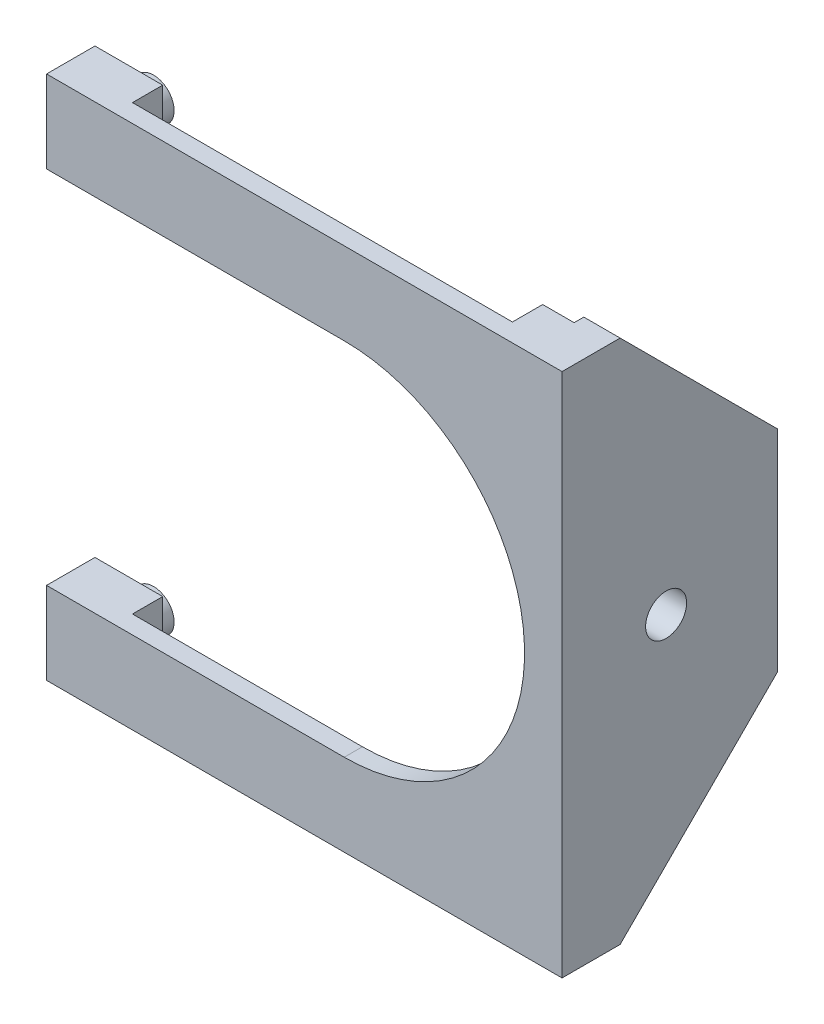
ISO-10303-21;
HEADER;
FILE_DESCRIPTION(('STEP AP214'),'2;1');
FILE_NAME('part.step','',(''),(''),'','','');
FILE_SCHEMA(('AUTOMOTIVE_DESIGN { 1 0 10303 214 1 1 1 1 }'));
ENDSEC;
DATA;
#1=APPLICATION_CONTEXT('core data for automotive mechanical design processes');
#2=APPLICATION_PROTOCOL_DEFINITION('international standard','automotive_design',2000,#1);
#3=PRODUCT_CONTEXT('',#1,'mechanical');
#4=PRODUCT('Part','Part','',(#3));
#5=PRODUCT_RELATED_PRODUCT_CATEGORY('part','',(#4));
#6=PRODUCT_DEFINITION_FORMATION('','',#4);
#7=PRODUCT_DEFINITION_CONTEXT('part definition',#1,'design');
#8=PRODUCT_DEFINITION('design','',#6,#7);
#9=PRODUCT_DEFINITION_SHAPE('','',#8);
#10=(LENGTH_UNIT() NAMED_UNIT(*) SI_UNIT(.MILLI.,.METRE.));
#11=(NAMED_UNIT(*) PLANE_ANGLE_UNIT() SI_UNIT($,.RADIAN.));
#12=(NAMED_UNIT(*) SI_UNIT($,.STERADIAN.) SOLID_ANGLE_UNIT());
#13=UNCERTAINTY_MEASURE_WITH_UNIT(LENGTH_MEASURE(1.E-05),#10,'distance_accuracy_value','');
#14=(GEOMETRIC_REPRESENTATION_CONTEXT(3) GLOBAL_UNCERTAINTY_ASSIGNED_CONTEXT((#13)) GLOBAL_UNIT_ASSIGNED_CONTEXT((#10,
#11,#12)) REPRESENTATION_CONTEXT('',''));
#15=CARTESIAN_POINT('',(0.,0.,0.));
#16=DIRECTION('',(0.,0.,1.));
#17=DIRECTION('',(1.,0.,0.));
#18=AXIS2_PLACEMENT_3D('',#15,#16,#17);
#19=CARTESIAN_POINT('',(-43.18,27.559,-5.08000000000001));
#20=DIRECTION('',(0.,0.,1.));
#21=DIRECTION('',(1.,0.,0.));
#22=AXIS2_PLACEMENT_3D('',#19,#20,#21);
#23=PLANE('',#22);
#24=DIRECTION('',(1.,0.,0.));
#25=VECTOR('',#24,1.);
#26=CARTESIAN_POINT('',(-19.05,-18.923,-5.08));
#27=LINE('',#26,#25);
#28=CARTESIAN_POINT('',(-50.292,-18.923,-5.08000000000001));
#29=VERTEX_POINT('',#28);
#30=CARTESIAN_POINT('',(-43.18,-18.923,-5.08000000000001));
#31=VERTEX_POINT('',#30);
#32=EDGE_CURVE('E266',#29,#31,#27,.T.);
#33=ORIENTED_EDGE('',*,*,#32,.T.);
#34=DIRECTION('',(0.,-1.,0.));
#35=VECTOR('',#34,1.);
#36=CARTESIAN_POINT('',(-43.18,27.559,-5.08000000000001));
#37=LINE('',#36,#35);
#38=CARTESIAN_POINT('',(-43.18,-27.559,-5.08000000000001));
#39=VERTEX_POINT('',#38);
#40=EDGE_CURVE('E249',#31,#39,#37,.T.);
#41=ORIENTED_EDGE('',*,*,#40,.T.);
#42=DIRECTION('',(-1.,0.,0.));
#43=VECTOR('',#42,1.);
#44=CARTESIAN_POINT('',(-43.18,-27.559,-5.08000000000001));
#45=LINE('',#44,#43);
#46=CARTESIAN_POINT('',(-50.292,-27.559,-5.08000000000001));
#47=VERTEX_POINT('',#46);
#48=EDGE_CURVE('E196',#39,#47,#45,.T.);
#49=ORIENTED_EDGE('',*,*,#48,.T.);
#50=DIRECTION('',(0.,-1.,0.));
#51=VECTOR('',#50,1.);
#52=CARTESIAN_POINT('',(-50.292,27.559,-5.08000000000001));
#53=LINE('',#52,#51);
#54=EDGE_CURVE('E245',#29,#47,#53,.T.);
#55=ORIENTED_EDGE('',*,*,#54,.F.);
#56=EDGE_LOOP('',(#33,#41,#49,#55));
#57=FACE_BOUND('',#56,.T.);
#58=CARTESIAN_POINT('',(-46.736,-23.241,-5.08000000000001));
#59=DIRECTION('',(0.,0.,1.));
#60=DIRECTION('',(1.,0.,0.));
#61=AXIS2_PLACEMENT_3D('',#58,#59,#60);
#62=CIRCLE('',#61,2.15900000000001);
#63=CARTESIAN_POINT('',(-44.577,-23.241,-5.08000000000001));
#64=VERTEX_POINT('',#63);
#65=EDGE_CURVE('E326',#64,#64,#62,.F.);
#66=ORIENTED_EDGE('',*,*,#65,.F.);
#67=EDGE_LOOP('',(#66));
#68=FACE_BOUND('',#67,.T.);
#69=ADVANCED_FACE('F49',(#57,#68),#23,.F.);
#70=DIRECTION('',(-1.,0.,0.));
#71=VECTOR('',#70,1.);
#72=CARTESIAN_POINT('',(-19.05,18.923,-5.08));
#73=LINE('',#72,#71);
#74=CARTESIAN_POINT('',(-43.18,18.923,-5.08000000000001));
#75=VERTEX_POINT('',#74);
#76=CARTESIAN_POINT('',(-50.292,18.923,-5.08000000000001));
#77=VERTEX_POINT('',#76);
#78=EDGE_CURVE('E315',#75,#77,#73,.T.);
#79=ORIENTED_EDGE('',*,*,#78,.T.);
#80=CARTESIAN_POINT('',(-50.292,27.559,-5.08000000000001));
#81=VERTEX_POINT('',#80);
#82=EDGE_CURVE('E241',#81,#77,#53,.T.);
#83=ORIENTED_EDGE('',*,*,#82,.F.);
#84=DIRECTION('',(-1.,0.,0.));
#85=VECTOR('',#84,1.);
#86=CARTESIAN_POINT('',(-43.18,27.559,-5.08000000000001));
#87=LINE('',#86,#85);
#88=CARTESIAN_POINT('',(-43.18,27.559,-5.08000000000001));
#89=VERTEX_POINT('',#88);
#90=EDGE_CURVE('E224',#89,#81,#87,.T.);
#91=ORIENTED_EDGE('',*,*,#90,.F.);
#92=EDGE_CURVE('E246',#89,#75,#37,.T.);
#93=ORIENTED_EDGE('',*,*,#92,.T.);
#94=EDGE_LOOP('',(#79,#83,#91,#93));
#95=FACE_BOUND('',#94,.T.);
#96=CARTESIAN_POINT('',(-46.736,23.241,-5.08000000000001));
#97=DIRECTION('',(0.,0.,1.));
#98=DIRECTION('',(1.,0.,0.));
#99=AXIS2_PLACEMENT_3D('',#96,#97,#98);
#100=CIRCLE('',#99,2.15900000000001);
#101=CARTESIAN_POINT('',(-44.577,23.241,-5.08000000000001));
#102=VERTEX_POINT('',#101);
#103=EDGE_CURVE('E323',#102,#102,#100,.F.);
#104=ORIENTED_EDGE('',*,*,#103,.F.);
#105=EDGE_LOOP('',(#104));
#106=FACE_BOUND('',#105,.T.);
#107=ADVANCED_FACE('F407',(#95,#106),#23,.F.);
#108=CARTESIAN_POINT('',(-50.292,27.559,-22.606));
#109=DIRECTION('',(-1.,0.,0.));
#110=DIRECTION('',(0.,-1.,0.));
#111=AXIS2_PLACEMENT_3D('',#108,#109,#110);
#112=PLANE('',#111);
#113=ORIENTED_EDGE('',*,*,#82,.T.);
#114=DIRECTION('',(0.,0.,1.));
#115=VECTOR('',#114,1.);
#116=CARTESIAN_POINT('',(-50.292,18.923,-22.606));
#117=LINE('',#116,#115);
#118=CARTESIAN_POINT('',(-50.292,18.923,0.));
#119=VERTEX_POINT('',#118);
#120=EDGE_CURVE('E272',#77,#119,#117,.T.);
#121=ORIENTED_EDGE('',*,*,#120,.T.);
#122=DIRECTION('',(0.,-1.,0.));
#123=VECTOR('',#122,1.);
#124=CARTESIAN_POINT('',(-50.292,27.559,0.));
#125=LINE('',#124,#123);
#126=CARTESIAN_POINT('',(-50.292,27.559,0.));
#127=VERTEX_POINT('',#126);
#128=EDGE_CURVE('E268',#127,#119,#125,.T.);
#129=ORIENTED_EDGE('',*,*,#128,.F.);
#130=DIRECTION('',(0.,0.,1.));
#131=VECTOR('',#130,1.);
#132=CARTESIAN_POINT('',(-50.292,27.559,-22.606));
#133=LINE('',#132,#131);
#134=EDGE_CURVE('E296',#81,#127,#133,.T.);
#135=ORIENTED_EDGE('',*,*,#134,.F.);
#136=EDGE_LOOP('',(#113,#121,#129,#135));
#137=FACE_BOUND('',#136,.T.);
#138=ADVANCED_FACE('F411',(#137),#112,.T.);
#139=CARTESIAN_POINT('',(-50.292,27.559,-22.606));
#140=DIRECTION('',(0.,1.,0.));
#141=DIRECTION('',(0.,0.,1.));
#142=AXIS2_PLACEMENT_3D('',#139,#140,#141);
#143=PLANE('',#142);
#144=DIRECTION('',(0.,0.,1.));
#145=VECTOR('',#144,1.);
#146=CARTESIAN_POINT('',(3.81000000000001,27.559,-22.606));
#147=LINE('',#146,#145);
#148=CARTESIAN_POINT('',(3.81000000000001,27.559,-6.09600000000001));
#149=VERTEX_POINT('',#148);
#150=CARTESIAN_POINT('',(3.81000000000001,27.559,0.));
#151=VERTEX_POINT('',#150);
#152=EDGE_CURVE('E299',#149,#151,#147,.T.);
#153=ORIENTED_EDGE('',*,*,#152,.F.);
#154=DIRECTION('',(-1.,0.,0.));
#155=VECTOR('',#154,1.);
#156=CARTESIAN_POINT('',(0.,27.559,-6.09600000000001));
#157=LINE('',#156,#155);
#158=CARTESIAN_POINT('',(0.,27.559,-6.09600000000001));
#159=VERTEX_POINT('',#158);
#160=EDGE_CURVE('E13',#149,#159,#157,.T.);
#161=ORIENTED_EDGE('',*,*,#160,.T.);
#162=DIRECTION('',(0.,0.,1.));
#163=VECTOR('',#162,1.);
#164=CARTESIAN_POINT('',(0.,27.559,-5.08));
#165=LINE('',#164,#163);
#166=CARTESIAN_POINT('',(0.,27.559,-5.08));
#167=VERTEX_POINT('',#166);
#168=EDGE_CURVE('E188',#159,#167,#165,.T.);
#169=ORIENTED_EDGE('',*,*,#168,.T.);
#170=DIRECTION('',(-1.,0.,0.));
#171=VECTOR('',#170,1.);
#172=CARTESIAN_POINT('',(0.,27.559,-5.08));
#173=LINE('',#172,#171);
#174=CARTESIAN_POINT('',(-3.302,27.559,-5.08));
#175=VERTEX_POINT('',#174);
#176=EDGE_CURVE('E194',#167,#175,#173,.T.);
#177=ORIENTED_EDGE('',*,*,#176,.T.);
#178=DIRECTION('',(0.,0.,1.));
#179=VECTOR('',#178,1.);
#180=CARTESIAN_POINT('',(-3.302,27.559,-5.08));
#181=LINE('',#180,#179);
#182=CARTESIAN_POINT('',(-3.302,27.559,-1.905));
#183=VERTEX_POINT('',#182);
#184=EDGE_CURVE('E213',#175,#183,#181,.T.);
#185=ORIENTED_EDGE('',*,*,#184,.T.);
#186=DIRECTION('',(-1.,0.,0.));
#187=VECTOR('',#186,1.);
#188=CARTESIAN_POINT('',(-3.302,27.559,-1.905));
#189=LINE('',#188,#187);
#190=CARTESIAN_POINT('',(-43.18,27.559,-1.905));
#191=VERTEX_POINT('',#190);
#192=EDGE_CURVE('E215',#183,#191,#189,.T.);
#193=ORIENTED_EDGE('',*,*,#192,.T.);
#194=DIRECTION('',(0.,0.,-1.));
#195=VECTOR('',#194,1.);
#196=CARTESIAN_POINT('',(-43.18,27.559,-1.905));
#197=LINE('',#196,#195);
#198=EDGE_CURVE('E221',#191,#89,#197,.T.);
#199=ORIENTED_EDGE('',*,*,#198,.T.);
#200=ORIENTED_EDGE('',*,*,#90,.T.);
#201=ORIENTED_EDGE('',*,*,#134,.T.);
#202=DIRECTION('',(-1.,0.,0.));
#203=VECTOR('',#202,1.);
#204=CARTESIAN_POINT('',(-50.292,27.559,0.));
#205=LINE('',#204,#203);
#206=EDGE_CURVE('E273',#151,#127,#205,.T.);
#207=ORIENTED_EDGE('',*,*,#206,.F.);
#208=EDGE_LOOP('',(#153,#161,#169,#177,#185,#193,#199,#200,#201,#207));
#209=FACE_BOUND('',#208,.T.);
#210=ADVANCED_FACE('F191',(#209),#143,.T.);
#211=CARTESIAN_POINT('',(3.81000000000001,27.559,-22.606));
#212=DIRECTION('',(1.,0.,0.));
#213=DIRECTION('',(0.,0.,-1.));
#214=AXIS2_PLACEMENT_3D('',#211,#212,#213);
#215=PLANE('',#214);
#216=CARTESIAN_POINT('',(3.81000000000001,0.,-10.922));
#217=DIRECTION('',(1.,0.,0.));
#218=DIRECTION('',(0.,0.,-1.));
#219=AXIS2_PLACEMENT_3D('',#216,#217,#218);
#220=CIRCLE('',#219,2.15265);
#221=CARTESIAN_POINT('',(3.81000000000001,0.,-13.07465));
#222=VERTEX_POINT('',#221);
#223=EDGE_CURVE('E646',#222,#222,#220,.T.);
#224=ORIENTED_EDGE('',*,*,#223,.F.);
#225=EDGE_LOOP('',(#224));
#226=FACE_BOUND('',#225,.T.);
#227=DIRECTION('',(0.,0.,1.));
#228=VECTOR('',#227,1.);
#229=CARTESIAN_POINT('',(3.81000000000001,-27.559,-22.606));
#230=LINE('',#229,#228);
#231=CARTESIAN_POINT('',(3.81000000000001,-27.559,-6.096));
#232=VERTEX_POINT('',#231);
#233=CARTESIAN_POINT('',(3.81000000000001,-27.559,0.));
#234=VERTEX_POINT('',#233);
#235=EDGE_CURVE('E301',#232,#234,#230,.T.);
#236=ORIENTED_EDGE('',*,*,#235,.F.);
#237=DIRECTION('',(0.,0.707106781186549,-0.707106781186546));
#238=VECTOR('',#237,1.);
#239=CARTESIAN_POINT('',(3.81000000000001,8.25500000000009,-41.91));
#240=LINE('',#239,#238);
#241=CARTESIAN_POINT('',(3.81000000000001,-11.0489999999999,-22.606));
#242=VERTEX_POINT('',#241);
#243=EDGE_CURVE('E334',#232,#242,#240,.T.);
#244=ORIENTED_EDGE('',*,*,#243,.T.);
#245=DIRECTION('',(0.,1.,0.));
#246=VECTOR('',#245,1.);
#247=CARTESIAN_POINT('',(3.81000000000001,27.559,-22.606));
#248=LINE('',#247,#246);
#249=CARTESIAN_POINT('',(3.81000000000001,11.049,-22.606));
#250=VERTEX_POINT('',#249);
#251=EDGE_CURVE('E269',#242,#250,#248,.T.);
#252=ORIENTED_EDGE('',*,*,#251,.T.);
#253=DIRECTION('',(0.,0.707106781186549,0.707106781186546));
#254=VECTOR('',#253,1.);
#255=CARTESIAN_POINT('',(3.81000000000001,19.304,-14.351));
#256=LINE('',#255,#254);
#257=EDGE_CURVE('E332',#250,#149,#256,.T.);
#258=ORIENTED_EDGE('',*,*,#257,.T.);
#259=ORIENTED_EDGE('',*,*,#152,.T.);
#260=DIRECTION('',(0.,1.,0.));
#261=VECTOR('',#260,1.);
#262=CARTESIAN_POINT('',(3.81000000000001,27.559,0.));
#263=LINE('',#262,#261);
#264=EDGE_CURVE('E291',#234,#151,#263,.T.);
#265=ORIENTED_EDGE('',*,*,#264,.F.);
#266=EDGE_LOOP('',(#236,#244,#252,#258,#259,#265));
#267=FACE_BOUND('',#266,.T.);
#268=ADVANCED_FACE('F348',(#226,#267),#215,.T.);
#269=CARTESIAN_POINT('',(-50.292,-27.559,-22.606));
#270=DIRECTION('',(0.,-1.,0.));
#271=DIRECTION('',(0.,0.,-1.));
#272=AXIS2_PLACEMENT_3D('',#269,#270,#271);
#273=PLANE('',#272);
#274=DIRECTION('',(0.,0.,1.));
#275=VECTOR('',#274,1.);
#276=CARTESIAN_POINT('',(0.,-27.559,-5.08));
#277=LINE('',#276,#275);
#278=CARTESIAN_POINT('',(0.,-27.559,-6.09600000000001));
#279=VERTEX_POINT('',#278);
#280=CARTESIAN_POINT('',(0.,-27.559,-5.08));
#281=VERTEX_POINT('',#280);
#282=EDGE_CURVE('E202',#279,#281,#277,.T.);
#283=ORIENTED_EDGE('',*,*,#282,.F.);
#284=DIRECTION('',(1.,0.,0.));
#285=VECTOR('',#284,1.);
#286=CARTESIAN_POINT('',(3.81000000000001,-27.559,-6.09600000000001));
#287=LINE('',#286,#285);
#288=EDGE_CURVE('E329',#279,#232,#287,.T.);
#289=ORIENTED_EDGE('',*,*,#288,.T.);
#290=ORIENTED_EDGE('',*,*,#235,.T.);
#291=DIRECTION('',(1.,0.,0.));
#292=VECTOR('',#291,1.);
#293=CARTESIAN_POINT('',(-50.292,-27.559,0.));
#294=LINE('',#293,#292);
#295=CARTESIAN_POINT('',(-50.292,-27.559,0.));
#296=VERTEX_POINT('',#295);
#297=EDGE_CURVE('E288',#296,#234,#294,.T.);
#298=ORIENTED_EDGE('',*,*,#297,.F.);
#299=DIRECTION('',(0.,0.,1.));
#300=VECTOR('',#299,1.);
#301=CARTESIAN_POINT('',(-50.292,-27.559,-22.606));
#302=LINE('',#301,#300);
#303=EDGE_CURVE('E303',#47,#296,#302,.T.);
#304=ORIENTED_EDGE('',*,*,#303,.F.);
#305=ORIENTED_EDGE('',*,*,#48,.F.);
#306=DIRECTION('',(0.,0.,-1.));
#307=VECTOR('',#306,1.);
#308=CARTESIAN_POINT('',(-43.18,-27.559,-1.905));
#309=LINE('',#308,#307);
#310=CARTESIAN_POINT('',(-43.18,-27.559,-1.905));
#311=VERTEX_POINT('',#310);
#312=EDGE_CURVE('E237',#311,#39,#309,.T.);
#313=ORIENTED_EDGE('',*,*,#312,.F.);
#314=DIRECTION('',(-1.,0.,0.));
#315=VECTOR('',#314,1.);
#316=CARTESIAN_POINT('',(-3.302,-27.559,-1.905));
#317=LINE('',#316,#315);
#318=CARTESIAN_POINT('',(-3.302,-27.559,-1.905));
#319=VERTEX_POINT('',#318);
#320=EDGE_CURVE('E234',#319,#311,#317,.T.);
#321=ORIENTED_EDGE('',*,*,#320,.F.);
#322=DIRECTION('',(0.,0.,1.));
#323=VECTOR('',#322,1.);
#324=CARTESIAN_POINT('',(-3.302,-27.559,-5.08));
#325=LINE('',#324,#323);
#326=CARTESIAN_POINT('',(-3.302,-27.559,-5.08));
#327=VERTEX_POINT('',#326);
#328=EDGE_CURVE('E231',#327,#319,#325,.T.);
#329=ORIENTED_EDGE('',*,*,#328,.F.);
#330=DIRECTION('',(-1.,0.,0.));
#331=VECTOR('',#330,1.);
#332=CARTESIAN_POINT('',(0.,-27.559,-5.08));
#333=LINE('',#332,#331);
#334=EDGE_CURVE('E228',#281,#327,#333,.T.);
#335=ORIENTED_EDGE('',*,*,#334,.F.);
#336=EDGE_LOOP('',(#283,#289,#290,#298,#304,#305,#313,#321,#329,#335));
#337=FACE_BOUND('',#336,.T.);
#338=ADVANCED_FACE('F343',(#337),#273,.T.);
#339=CARTESIAN_POINT('',(-50.292,-18.923,-22.606));
#340=DIRECTION('',(-1.,0.,0.));
#341=DIRECTION('',(0.,-1.,0.));
#342=AXIS2_PLACEMENT_3D('',#339,#340,#341);
#343=PLANE('',#342);
#344=ORIENTED_EDGE('',*,*,#54,.T.);
#345=ORIENTED_EDGE('',*,*,#303,.T.);
#346=DIRECTION('',(0.,-1.,0.));
#347=VECTOR('',#346,1.);
#348=CARTESIAN_POINT('',(-50.292,-18.923,0.));
#349=LINE('',#348,#347);
#350=CARTESIAN_POINT('',(-50.292,-18.923,0.));
#351=VERTEX_POINT('',#350);
#352=EDGE_CURVE('E285',#351,#296,#349,.T.);
#353=ORIENTED_EDGE('',*,*,#352,.F.);
#354=DIRECTION('',(0.,0.,1.));
#355=VECTOR('',#354,1.);
#356=CARTESIAN_POINT('',(-50.292,-18.923,-22.606));
#357=LINE('',#356,#355);
#358=EDGE_CURVE('E305',#29,#351,#357,.T.);
#359=ORIENTED_EDGE('',*,*,#358,.F.);
#360=EDGE_LOOP('',(#344,#345,#353,#359));
#361=FACE_BOUND('',#360,.T.);
#362=ADVANCED_FACE('F364',(#361),#343,.T.);
#363=CARTESIAN_POINT('',(-19.05,-18.923,-22.606));
#364=DIRECTION('',(0.,1.,0.));
#365=DIRECTION('',(-1.,0.,0.));
#366=AXIS2_PLACEMENT_3D('',#363,#364,#365);
#367=PLANE('',#366);
#368=ORIENTED_EDGE('',*,*,#32,.F.);
#369=ORIENTED_EDGE('',*,*,#358,.T.);
#370=DIRECTION('',(-1.,0.,0.));
#371=VECTOR('',#370,1.);
#372=CARTESIAN_POINT('',(-19.05,-18.923,0.));
#373=LINE('',#372,#371);
#374=CARTESIAN_POINT('',(-19.05,-18.923,0.));
#375=VERTEX_POINT('',#374);
#376=EDGE_CURVE('E282',#375,#351,#373,.T.);
#377=ORIENTED_EDGE('',*,*,#376,.F.);
#378=DIRECTION('',(0.,0.,1.));
#379=VECTOR('',#378,1.);
#380=CARTESIAN_POINT('',(-19.05,-18.923,-22.606));
#381=LINE('',#380,#379);
#382=CARTESIAN_POINT('',(-19.05,-18.923,-1.905));
#383=VERTEX_POINT('',#382);
#384=EDGE_CURVE('E307',#383,#375,#381,.T.);
#385=ORIENTED_EDGE('',*,*,#384,.F.);
#386=DIRECTION('',(1.,0.,0.));
#387=VECTOR('',#386,1.);
#388=CARTESIAN_POINT('',(-19.05,-18.923,-1.905));
#389=LINE('',#388,#387);
#390=CARTESIAN_POINT('',(-43.18,-18.923,-1.905));
#391=VERTEX_POINT('',#390);
#392=EDGE_CURVE('E262',#391,#383,#389,.T.);
#393=ORIENTED_EDGE('',*,*,#392,.F.);
#394=DIRECTION('',(0.,0.,1.));
#395=VECTOR('',#394,1.);
#396=CARTESIAN_POINT('',(-43.1800000000001,-18.923,-22.6059999999999));
#397=LINE('',#396,#395);
#398=EDGE_CURVE('E264',#31,#391,#397,.T.);
#399=ORIENTED_EDGE('',*,*,#398,.F.);
#400=EDGE_LOOP('',(#368,#369,#377,#385,#393,#399));
#401=FACE_BOUND('',#400,.T.);
#402=ADVANCED_FACE('F372',(#401),#367,.T.);
#403=CARTESIAN_POINT('',(-19.05,0.,-22.606));
#404=DIRECTION('',(0.,0.,1.));
#405=DIRECTION('',(1.,0.,0.));
#406=AXIS2_PLACEMENT_3D('',#403,#404,#405);
#407=CYLINDRICAL_SURFACE('',#406,18.923);
#408=CARTESIAN_POINT('',(-19.05,0.,-1.905));
#409=DIRECTION('',(0.,0.,1.));
#410=DIRECTION('',(1.,0.,0.));
#411=AXIS2_PLACEMENT_3D('',#408,#409,#410);
#412=CIRCLE('',#411,18.923);
#413=CARTESIAN_POINT('',(-3.302,10.49192189258,-1.905));
#414=VERTEX_POINT('',#413);
#415=CARTESIAN_POINT('',(-19.05,18.923,-1.905));
#416=VERTEX_POINT('',#415);
#417=EDGE_CURVE('E244',#414,#416,#412,.T.);
#418=ORIENTED_EDGE('',*,*,#417,.F.);
#419=DIRECTION('',(0.,0.,1.));
#420=VECTOR('',#419,1.);
#421=CARTESIAN_POINT('',(-3.30200000000001,10.49192189258,-22.606));
#422=LINE('',#421,#420);
#423=CARTESIAN_POINT('',(-3.30200000000001,10.49192189258,-5.08));
#424=VERTEX_POINT('',#423);
#425=EDGE_CURVE('E321',#424,#414,#422,.T.);
#426=ORIENTED_EDGE('',*,*,#425,.F.);
#427=CARTESIAN_POINT('',(-19.05,0.,-5.08000000000001));
#428=DIRECTION('',(0.,0.,1.));
#429=DIRECTION('',(1.,0.,0.));
#430=AXIS2_PLACEMENT_3D('',#427,#428,#429);
#431=CIRCLE('',#430,18.923);
#432=CARTESIAN_POINT('',(-3.30200000000001,-10.49192189258,-5.08));
#433=VERTEX_POINT('',#432);
#434=EDGE_CURVE('E317',#433,#424,#431,.T.);
#435=ORIENTED_EDGE('',*,*,#434,.F.);
#436=DIRECTION('',(0.,0.,1.));
#437=VECTOR('',#436,1.);
#438=CARTESIAN_POINT('',(-3.30200000000001,-10.49192189258,-22.606));
#439=LINE('',#438,#437);
#440=CARTESIAN_POINT('',(-3.302,-10.49192189258,-1.905));
#441=VERTEX_POINT('',#440);
#442=EDGE_CURVE('E319',#441,#433,#439,.F.);
#443=ORIENTED_EDGE('',*,*,#442,.F.);
#444=EDGE_CURVE('E261',#383,#441,#412,.T.);
#445=ORIENTED_EDGE('',*,*,#444,.F.);
#446=ORIENTED_EDGE('',*,*,#384,.T.);
#447=CARTESIAN_POINT('',(-19.05,0.,0.));
#448=DIRECTION('',(0.,0.,-1.));
#449=DIRECTION('',(1.,0.,0.));
#450=AXIS2_PLACEMENT_3D('',#447,#448,#449);
#451=CIRCLE('',#450,18.923);
#452=CARTESIAN_POINT('',(-19.05,18.923,0.));
#453=VERTEX_POINT('',#452);
#454=EDGE_CURVE('E279',#453,#375,#451,.T.);
#455=ORIENTED_EDGE('',*,*,#454,.F.);
#456=DIRECTION('',(0.,0.,1.));
#457=VECTOR('',#456,1.);
#458=CARTESIAN_POINT('',(-19.05,18.923,-22.606));
#459=LINE('',#458,#457);
#460=EDGE_CURVE('E309',#416,#453,#459,.T.);
#461=ORIENTED_EDGE('',*,*,#460,.F.);
#462=EDGE_LOOP('',(#418,#426,#435,#443,#445,#446,#455,#461));
#463=FACE_BOUND('',#462,.T.);
#464=ADVANCED_FACE('F392',(#463),#407,.F.);
#465=CARTESIAN_POINT('',(-19.05,18.923,-22.606));
#466=DIRECTION('',(0.,-1.,0.));
#467=DIRECTION('',(1.,0.,0.));
#468=AXIS2_PLACEMENT_3D('',#465,#466,#467);
#469=PLANE('',#468);
#470=ORIENTED_EDGE('',*,*,#78,.F.);
#471=DIRECTION('',(0.,0.,-1.));
#472=VECTOR('',#471,1.);
#473=CARTESIAN_POINT('',(-43.1800000000001,18.923,-22.6059999999999));
#474=LINE('',#473,#472);
#475=CARTESIAN_POINT('',(-43.18,18.923,-1.905));
#476=VERTEX_POINT('',#475);
#477=EDGE_CURVE('E313',#476,#75,#474,.T.);
#478=ORIENTED_EDGE('',*,*,#477,.F.);
#479=DIRECTION('',(-1.,0.,0.));
#480=VECTOR('',#479,1.);
#481=CARTESIAN_POINT('',(-19.05,18.923,-1.905));
#482=LINE('',#481,#480);
#483=EDGE_CURVE('E298',#416,#476,#482,.T.);
#484=ORIENTED_EDGE('',*,*,#483,.F.);
#485=ORIENTED_EDGE('',*,*,#460,.T.);
#486=DIRECTION('',(1.,0.,0.));
#487=VECTOR('',#486,1.);
#488=CARTESIAN_POINT('',(-19.05,18.923,0.));
#489=LINE('',#488,#487);
#490=EDGE_CURVE('E276',#119,#453,#489,.T.);
#491=ORIENTED_EDGE('',*,*,#490,.F.);
#492=ORIENTED_EDGE('',*,*,#120,.F.);
#493=EDGE_LOOP('',(#470,#478,#484,#485,#491,#492));
#494=FACE_BOUND('',#493,.T.);
#495=ADVANCED_FACE('F414',(#494),#469,.T.);
#496=CARTESIAN_POINT('',(-19.05,0.,-22.606));
#497=DIRECTION('',(0.,0.,1.));
#498=DIRECTION('',(1.,0.,0.));
#499=AXIS2_PLACEMENT_3D('',#496,#497,#498);
#500=PLANE('',#499);
#501=ORIENTED_EDGE('',*,*,#251,.F.);
#502=DIRECTION('',(-1.,0.,0.));
#503=VECTOR('',#502,1.);
#504=CARTESIAN_POINT('',(0.,-11.049,-22.606));
#505=LINE('',#504,#503);
#506=CARTESIAN_POINT('',(0.,-11.049,-22.606));
#507=VERTEX_POINT('',#506);
#508=EDGE_CURVE('E71',#242,#507,#505,.T.);
#509=ORIENTED_EDGE('',*,*,#508,.T.);
#510=DIRECTION('',(0.,-1.,0.));
#511=VECTOR('',#510,1.);
#512=CARTESIAN_POINT('',(0.,27.559,-22.606));
#513=LINE('',#512,#511);
#514=CARTESIAN_POINT('',(0.,11.049,-22.606));
#515=VERTEX_POINT('',#514);
#516=EDGE_CURVE('E207',#515,#507,#513,.T.);
#517=ORIENTED_EDGE('',*,*,#516,.F.);
#518=DIRECTION('',(1.,0.,0.));
#519=VECTOR('',#518,1.);
#520=CARTESIAN_POINT('',(3.81000000000001,11.049,-22.606));
#521=LINE('',#520,#519);
#522=EDGE_CURVE('E336',#515,#250,#521,.T.);
#523=ORIENTED_EDGE('',*,*,#522,.T.);
#524=EDGE_LOOP('',(#501,#509,#517,#523));
#525=FACE_BOUND('',#524,.T.);
#526=ADVANCED_FACE('F351',(#525),#500,.F.);
#527=CARTESIAN_POINT('',(-19.05,0.,0.));
#528=DIRECTION('',(0.,0.,1.));
#529=DIRECTION('',(1.,0.,0.));
#530=AXIS2_PLACEMENT_3D('',#527,#528,#529);
#531=PLANE('',#530);
#532=ORIENTED_EDGE('',*,*,#128,.T.);
#533=ORIENTED_EDGE('',*,*,#490,.T.);
#534=ORIENTED_EDGE('',*,*,#454,.T.);
#535=ORIENTED_EDGE('',*,*,#376,.T.);
#536=ORIENTED_EDGE('',*,*,#352,.T.);
#537=ORIENTED_EDGE('',*,*,#297,.T.);
#538=ORIENTED_EDGE('',*,*,#264,.T.);
#539=ORIENTED_EDGE('',*,*,#206,.T.);
#540=EDGE_LOOP('',(#532,#533,#534,#535,#536,#537,#538,#539));
#541=FACE_BOUND('',#540,.T.);
#542=ADVANCED_FACE('F356',(#541),#531,.T.);
#543=CARTESIAN_POINT('',(-3.302,27.559,-5.08));
#544=DIRECTION('',(1.,0.,0.));
#545=DIRECTION('',(0.,0.,-1.));
#546=AXIS2_PLACEMENT_3D('',#543,#544,#545);
#547=PLANE('',#546);
#548=ORIENTED_EDGE('',*,*,#425,.T.);
#549=DIRECTION('',(0.,-1.,0.));
#550=VECTOR('',#549,1.);
#551=CARTESIAN_POINT('',(-3.302,27.559,-1.905));
#552=LINE('',#551,#550);
#553=EDGE_CURVE('E254',#183,#414,#552,.T.);
#554=ORIENTED_EDGE('',*,*,#553,.F.);
#555=ORIENTED_EDGE('',*,*,#184,.F.);
#556=DIRECTION('',(0.,-1.,0.));
#557=VECTOR('',#556,1.);
#558=CARTESIAN_POINT('',(-3.302,27.559,-5.08));
#559=LINE('',#558,#557);
#560=EDGE_CURVE('E211',#175,#424,#559,.T.);
#561=ORIENTED_EDGE('',*,*,#560,.T.);
#562=EDGE_LOOP('',(#548,#554,#555,#561));
#563=FACE_BOUND('',#562,.T.);
#564=ADVANCED_FACE('F395',(#563),#547,.F.);
#565=CARTESIAN_POINT('',(-43.18,27.559,-1.905));
#566=DIRECTION('',(-1.,0.,0.));
#567=DIRECTION('',(0.,0.,1.));
#568=AXIS2_PLACEMENT_3D('',#565,#566,#567);
#569=PLANE('',#568);
#570=ORIENTED_EDGE('',*,*,#398,.T.);
#571=DIRECTION('',(0.,-1.,0.));
#572=VECTOR('',#571,1.);
#573=CARTESIAN_POINT('',(-43.18,27.559,-1.905));
#574=LINE('',#573,#572);
#575=EDGE_CURVE('E253',#391,#311,#574,.T.);
#576=ORIENTED_EDGE('',*,*,#575,.T.);
#577=ORIENTED_EDGE('',*,*,#312,.T.);
#578=ORIENTED_EDGE('',*,*,#40,.F.);
#579=EDGE_LOOP('',(#570,#576,#577,#578));
#580=FACE_BOUND('',#579,.T.);
#581=ADVANCED_FACE('F378',(#580),#569,.F.);
#582=CARTESIAN_POINT('',(-3.302,27.559,-1.905));
#583=DIRECTION('',(0.,0.,1.));
#584=DIRECTION('',(1.,0.,0.));
#585=AXIS2_PLACEMENT_3D('',#582,#583,#584);
#586=PLANE('',#585);
#587=ORIENTED_EDGE('',*,*,#392,.T.);
#588=ORIENTED_EDGE('',*,*,#444,.T.);
#589=EDGE_CURVE('E257',#441,#319,#552,.T.);
#590=ORIENTED_EDGE('',*,*,#589,.T.);
#591=ORIENTED_EDGE('',*,*,#320,.T.);
#592=ORIENTED_EDGE('',*,*,#575,.F.);
#593=EDGE_LOOP('',(#587,#588,#590,#591,#592));
#594=FACE_BOUND('',#593,.T.);
#595=ADVANCED_FACE('F380',(#594),#586,.F.);
#596=ORIENTED_EDGE('',*,*,#477,.T.);
#597=ORIENTED_EDGE('',*,*,#92,.F.);
#598=ORIENTED_EDGE('',*,*,#198,.F.);
#599=EDGE_CURVE('E250',#191,#476,#574,.T.);
#600=ORIENTED_EDGE('',*,*,#599,.T.);
#601=EDGE_LOOP('',(#596,#597,#598,#600));
#602=FACE_BOUND('',#601,.T.);
#603=ADVANCED_FACE('F403',(#602),#569,.F.);
#604=ORIENTED_EDGE('',*,*,#417,.T.);
#605=ORIENTED_EDGE('',*,*,#483,.T.);
#606=ORIENTED_EDGE('',*,*,#599,.F.);
#607=ORIENTED_EDGE('',*,*,#192,.F.);
#608=ORIENTED_EDGE('',*,*,#553,.T.);
#609=EDGE_LOOP('',(#604,#605,#606,#607,#608));
#610=FACE_BOUND('',#609,.T.);
#611=ADVANCED_FACE('F398',(#610),#586,.F.);
#612=ORIENTED_EDGE('',*,*,#442,.T.);
#613=EDGE_CURVE('E206',#433,#327,#559,.T.);
#614=ORIENTED_EDGE('',*,*,#613,.T.);
#615=ORIENTED_EDGE('',*,*,#328,.T.);
#616=ORIENTED_EDGE('',*,*,#589,.F.);
#617=EDGE_LOOP('',(#612,#614,#615,#616));
#618=FACE_BOUND('',#617,.T.);
#619=ADVANCED_FACE('F385',(#618),#547,.F.);
#620=CARTESIAN_POINT('',(0.,27.559,-5.08));
#621=DIRECTION('',(0.,0.,1.));
#622=DIRECTION('',(1.,0.,0.));
#623=AXIS2_PLACEMENT_3D('',#620,#621,#622);
#624=PLANE('',#623);
#625=ORIENTED_EDGE('',*,*,#434,.T.);
#626=ORIENTED_EDGE('',*,*,#560,.F.);
#627=ORIENTED_EDGE('',*,*,#176,.F.);
#628=DIRECTION('',(0.,-1.,0.));
#629=VECTOR('',#628,1.);
#630=CARTESIAN_POINT('',(0.,27.559,-5.08));
#631=LINE('',#630,#629);
#632=EDGE_CURVE('E199',#167,#281,#631,.T.);
#633=ORIENTED_EDGE('',*,*,#632,.T.);
#634=ORIENTED_EDGE('',*,*,#334,.T.);
#635=ORIENTED_EDGE('',*,*,#613,.F.);
#636=EDGE_LOOP('',(#625,#626,#627,#633,#634,#635));
#637=FACE_BOUND('',#636,.T.);
#638=ADVANCED_FACE('F209',(#637),#624,.F.);
#639=CARTESIAN_POINT('',(0.,27.559,-5.08));
#640=DIRECTION('',(1.,0.,0.));
#641=DIRECTION('',(0.,0.,-1.));
#642=AXIS2_PLACEMENT_3D('',#639,#640,#641);
#643=PLANE('',#642);
#644=CARTESIAN_POINT('',(0.,0.,-10.922));
#645=DIRECTION('',(1.,0.,0.));
#646=DIRECTION('',(0.,0.,-1.));
#647=AXIS2_PLACEMENT_3D('',#644,#645,#646);
#648=CIRCLE('',#647,2.15265);
#649=CARTESIAN_POINT('',(0.,0.,-13.07465));
#650=VERTEX_POINT('',#649);
#651=EDGE_CURVE('E229',#650,#650,#648,.T.);
#652=ORIENTED_EDGE('',*,*,#651,.T.);
#653=EDGE_LOOP('',(#652));
#654=FACE_BOUND('',#653,.T.);
#655=ORIENTED_EDGE('',*,*,#516,.T.);
#656=DIRECTION('',(0.,-0.707106781186549,0.707106781186546));
#657=VECTOR('',#656,1.);
#658=CARTESIAN_POINT('',(0.,-27.559,-6.09600000000001));
#659=LINE('',#658,#657);
#660=EDGE_CURVE('E57',#507,#279,#659,.T.);
#661=ORIENTED_EDGE('',*,*,#660,.T.);
#662=ORIENTED_EDGE('',*,*,#282,.T.);
#663=ORIENTED_EDGE('',*,*,#632,.F.);
#664=ORIENTED_EDGE('',*,*,#168,.F.);
#665=DIRECTION('',(0.,-0.707106781186549,-0.707106781186546));
#666=VECTOR('',#665,1.);
#667=CARTESIAN_POINT('',(0.,27.559,-6.09600000000001));
#668=LINE('',#667,#666);
#669=EDGE_CURVE('E64',#159,#515,#668,.T.);
#670=ORIENTED_EDGE('',*,*,#669,.T.);
#671=EDGE_LOOP('',(#655,#661,#662,#663,#664,#670));
#672=FACE_BOUND('',#671,.T.);
#673=ADVANCED_FACE('F200',(#654,#672),#643,.F.);
#674=CARTESIAN_POINT('',(3.81000000000001,0.,-10.922));
#675=DIRECTION('',(1.,0.,0.));
#676=DIRECTION('',(0.,0.,-1.));
#677=AXIS2_PLACEMENT_3D('',#674,#675,#676);
#678=CYLINDRICAL_SURFACE('',#677,2.15265);
#679=ORIENTED_EDGE('',*,*,#651,.F.);
#680=EDGE_LOOP('',(#679));
#681=FACE_BOUND('',#680,.T.);
#682=ORIENTED_EDGE('',*,*,#223,.T.);
#683=EDGE_LOOP('',(#682));
#684=FACE_BOUND('',#683,.T.);
#685=ADVANCED_FACE('F432',(#681,#684),#678,.F.);
#686=CARTESIAN_POINT('',(-46.736,23.241,-1.7018));
#687=DIRECTION('',(0.,0.,-1.));
#688=DIRECTION('',(1.,0.,0.));
#689=AXIS2_PLACEMENT_3D('',#686,#687,#688);
#690=SPHERICAL_SURFACE('',#689,6.35);
#691=CARTESIAN_POINT('',(-46.736,23.241,-7.67350151631845));
#692=DIRECTION('',(0.,0.,-1.));
#693=DIRECTION('',(-1.,0.,0.));
#694=AXIS2_PLACEMENT_3D('',#691,#692,#693);
#695=CIRCLE('',#694,2.15900000000001);
#696=CARTESIAN_POINT('',(-48.895,23.241,-7.67350151631845));
#697=VERTEX_POINT('',#696);
#698=EDGE_CURVE('E643',#697,#697,#695,.T.);
#699=ORIENTED_EDGE('',*,*,#698,.T.);
#700=EDGE_LOOP('',(#699));
#701=FACE_BOUND('',#700,.T.);
#702=ADVANCED_FACE('F526',(#701),#690,.T.);
#703=CARTESIAN_POINT('',(-46.736,23.241,-5.08000000000001));
#704=DIRECTION('',(0.,0.,-1.));
#705=DIRECTION('',(-1.,0.,0.));
#706=AXIS2_PLACEMENT_3D('',#703,#704,#705);
#707=CYLINDRICAL_SURFACE('',#706,2.15900000000001);
#708=ORIENTED_EDGE('',*,*,#698,.F.);
#709=EDGE_LOOP('',(#708));
#710=FACE_BOUND('',#709,.T.);
#711=ORIENTED_EDGE('',*,*,#103,.T.);
#712=EDGE_LOOP('',(#711));
#713=FACE_BOUND('',#712,.T.);
#714=ADVANCED_FACE('F542',(#710,#713),#707,.T.);
#715=CARTESIAN_POINT('',(-46.736,-23.241,-1.7018));
#716=DIRECTION('',(0.,0.,-1.));
#717=DIRECTION('',(1.,0.,0.));
#718=AXIS2_PLACEMENT_3D('',#715,#716,#717);
#719=SPHERICAL_SURFACE('',#718,6.35);
#720=CARTESIAN_POINT('',(-46.736,-23.241,-7.67350151631845));
#721=DIRECTION('',(0.,0.,1.));
#722=DIRECTION('',(-1.,0.,0.));
#723=AXIS2_PLACEMENT_3D('',#720,#721,#722);
#724=CIRCLE('',#723,2.15900000000001);
#725=CARTESIAN_POINT('',(-48.895,-23.241,-7.67350151631845));
#726=VERTEX_POINT('',#725);
#727=EDGE_CURVE('E641',#726,#726,#724,.T.);
#728=ORIENTED_EDGE('',*,*,#727,.F.);
#729=EDGE_LOOP('',(#728));
#730=FACE_BOUND('',#729,.T.);
#731=ADVANCED_FACE('F550',(#730),#719,.T.);
#732=CARTESIAN_POINT('',(-46.736,-23.241,-5.08000000000001));
#733=DIRECTION('',(0.,0.,-1.));
#734=DIRECTION('',(-1.,0.,0.));
#735=AXIS2_PLACEMENT_3D('',#732,#733,#734);
#736=CYLINDRICAL_SURFACE('',#735,2.15900000000001);
#737=ORIENTED_EDGE('',*,*,#727,.T.);
#738=EDGE_LOOP('',(#737));
#739=FACE_BOUND('',#738,.T.);
#740=ORIENTED_EDGE('',*,*,#65,.T.);
#741=EDGE_LOOP('',(#740));
#742=FACE_BOUND('',#741,.T.);
#743=ADVANCED_FACE('F565',(#739,#742),#736,.T.);
#744=CARTESIAN_POINT('',(-50.292,-27.559,-6.09600000000001));
#745=DIRECTION('',(0.,-0.707106781186546,-0.707106781186549));
#746=DIRECTION('',(-1.,0.,0.));
#747=AXIS2_PLACEMENT_3D('',#744,#745,#746);
#748=PLANE('',#747);
#749=ORIENTED_EDGE('',*,*,#660,.F.);
#750=ORIENTED_EDGE('',*,*,#508,.F.);
#751=ORIENTED_EDGE('',*,*,#243,.F.);
#752=ORIENTED_EDGE('',*,*,#288,.F.);
#753=EDGE_LOOP('',(#749,#750,#751,#752));
#754=FACE_BOUND('',#753,.T.);
#755=ADVANCED_FACE('F346',(#754),#748,.T.);
#756=CARTESIAN_POINT('',(-50.292,27.559,-6.09600000000001));
#757=DIRECTION('',(0.,0.707106781186546,-0.707106781186549));
#758=DIRECTION('',(1.,0.,0.));
#759=AXIS2_PLACEMENT_3D('',#756,#757,#758);
#760=PLANE('',#759);
#761=ORIENTED_EDGE('',*,*,#257,.F.);
#762=ORIENTED_EDGE('',*,*,#522,.F.);
#763=ORIENTED_EDGE('',*,*,#669,.F.);
#764=ORIENTED_EDGE('',*,*,#160,.F.);
#765=EDGE_LOOP('',(#761,#762,#763,#764));
#766=FACE_BOUND('',#765,.T.);
#767=ADVANCED_FACE('F51',(#766),#760,.T.);
#768=CLOSED_SHELL('',(#69,#107,#138,#210,#268,#338,#362,#402,#464,#495,#526,#542,#564,#581,#595,
#603,#611,#619,#638,#673,#685,#702,#714,#731,#743,#755,#767));
#769=MANIFOLD_SOLID_BREP('B2',#768);
#770=ADVANCED_BREP_SHAPE_REPRESENTATION('',(#18,#769),#14);
#771=SHAPE_DEFINITION_REPRESENTATION(#9,#770);
ENDSEC;
END-ISO-10303-21;
